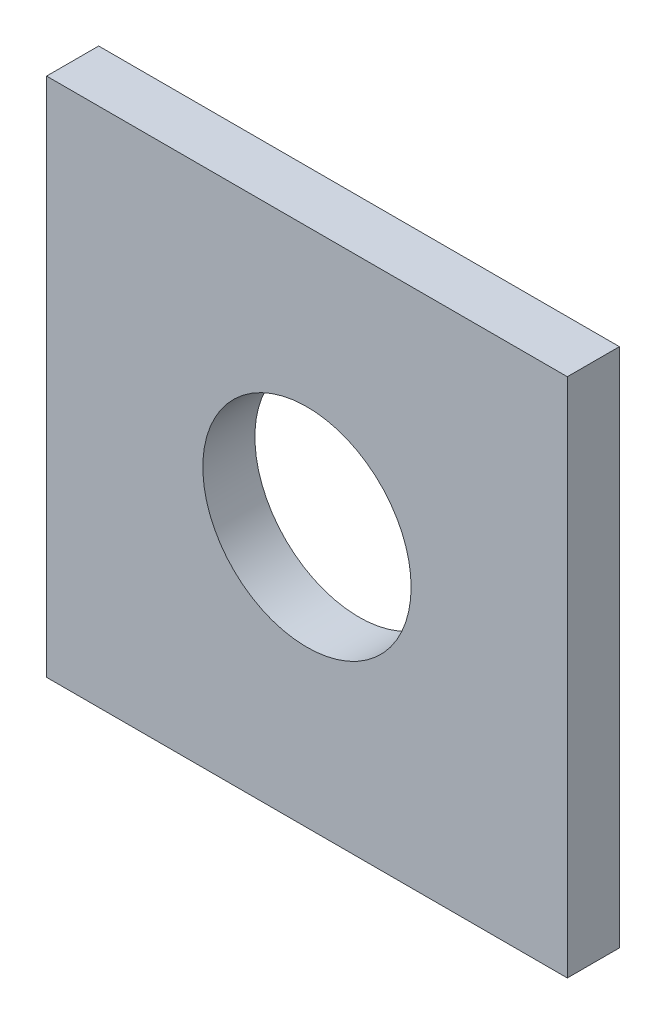
ISO-10303-21;
HEADER;
FILE_DESCRIPTION(('STEP AP214'),'2;1');
FILE_NAME('part.step','',(''),(''),'','','');
FILE_SCHEMA(('AUTOMOTIVE_DESIGN { 1 0 10303 214 1 1 1 1 }'));
ENDSEC;
DATA;
#1=APPLICATION_CONTEXT('core data for automotive mechanical design processes');
#2=APPLICATION_PROTOCOL_DEFINITION('international standard','automotive_design',2000,#1);
#3=PRODUCT_CONTEXT('',#1,'mechanical');
#4=PRODUCT('Part','Part','',(#3));
#5=PRODUCT_RELATED_PRODUCT_CATEGORY('part','',(#4));
#6=PRODUCT_DEFINITION_FORMATION('','',#4);
#7=PRODUCT_DEFINITION_CONTEXT('part definition',#1,'design');
#8=PRODUCT_DEFINITION('design','',#6,#7);
#9=PRODUCT_DEFINITION_SHAPE('','',#8);
#10=(LENGTH_UNIT() NAMED_UNIT(*) SI_UNIT(.MILLI.,.METRE.));
#11=(NAMED_UNIT(*) PLANE_ANGLE_UNIT() SI_UNIT($,.RADIAN.));
#12=(NAMED_UNIT(*) SI_UNIT($,.STERADIAN.) SOLID_ANGLE_UNIT());
#13=UNCERTAINTY_MEASURE_WITH_UNIT(LENGTH_MEASURE(1.E-05),#10,'distance_accuracy_value','');
#14=(GEOMETRIC_REPRESENTATION_CONTEXT(3) GLOBAL_UNCERTAINTY_ASSIGNED_CONTEXT((#13)) GLOBAL_UNIT_ASSIGNED_CONTEXT((#10,
#11,#12)) REPRESENTATION_CONTEXT('',''));
#15=CARTESIAN_POINT('',(0.,0.,0.));
#16=DIRECTION('',(0.,0.,1.));
#17=DIRECTION('',(1.,0.,0.));
#18=AXIS2_PLACEMENT_3D('',#15,#16,#17);
#19=CARTESIAN_POINT('',(0.,0.,1.));
#20=DIRECTION('',(0.,0.,-1.));
#21=DIRECTION('',(-1.,0.,0.));
#22=AXIS2_PLACEMENT_3D('',#19,#20,#21);
#23=PLANE('',#22);
#24=DIRECTION('',(1.,0.,0.));
#25=VECTOR('',#24,1.);
#26=CARTESIAN_POINT('',(10.,0.,1.));
#27=LINE('',#26,#25);
#28=CARTESIAN_POINT('',(0.,0.,1.));
#29=VERTEX_POINT('',#28);
#30=CARTESIAN_POINT('',(10.,0.,1.));
#31=VERTEX_POINT('',#30);
#32=EDGE_CURVE('E89',#29,#31,#27,.T.);
#33=ORIENTED_EDGE('',*,*,#32,.T.);
#34=DIRECTION('',(0.,1.,0.));
#35=VECTOR('',#34,1.);
#36=CARTESIAN_POINT('',(10.,10.,1.));
#37=LINE('',#36,#35);
#38=CARTESIAN_POINT('',(10.,10.,1.));
#39=VERTEX_POINT('',#38);
#40=EDGE_CURVE('E84',#31,#39,#37,.T.);
#41=ORIENTED_EDGE('',*,*,#40,.T.);
#42=DIRECTION('',(-1.,0.,0.));
#43=VECTOR('',#42,1.);
#44=CARTESIAN_POINT('',(0.,10.,1.));
#45=LINE('',#44,#43);
#46=CARTESIAN_POINT('',(0.,10.,1.));
#47=VERTEX_POINT('',#46);
#48=EDGE_CURVE('E87',#39,#47,#45,.T.);
#49=ORIENTED_EDGE('',*,*,#48,.T.);
#50=DIRECTION('',(0.,-1.,0.));
#51=VECTOR('',#50,1.);
#52=CARTESIAN_POINT('',(0.,0.,1.));
#53=LINE('',#52,#51);
#54=EDGE_CURVE('E54',#47,#29,#53,.T.);
#55=ORIENTED_EDGE('',*,*,#54,.T.);
#56=EDGE_LOOP('',(#33,#41,#49,#55));
#57=FACE_BOUND('',#56,.T.);
#58=CARTESIAN_POINT('',(5.,5.,1.));
#59=DIRECTION('',(0.,0.,1.));
#60=DIRECTION('',(1.,0.,0.));
#61=AXIS2_PLACEMENT_3D('',#58,#59,#60);
#62=CIRCLE('',#61,2.);
#63=CARTESIAN_POINT('',(7.,5.,1.));
#64=VERTEX_POINT('',#63);
#65=EDGE_CURVE('E104',#64,#64,#62,.T.);
#66=ORIENTED_EDGE('',*,*,#65,.F.);
#67=EDGE_LOOP('',(#66));
#68=FACE_BOUND('',#67,.T.);
#69=ADVANCED_FACE('F37',(#57,#68),#23,.F.);
#70=CARTESIAN_POINT('',(0.,0.,0.));
#71=DIRECTION('',(0.,0.,-1.));
#72=DIRECTION('',(-1.,0.,0.));
#73=AXIS2_PLACEMENT_3D('',#70,#71,#72);
#74=PLANE('',#73);
#75=DIRECTION('',(1.,0.,0.));
#76=VECTOR('',#75,1.);
#77=CARTESIAN_POINT('',(10.,0.,0.));
#78=LINE('',#77,#76);
#79=CARTESIAN_POINT('',(0.,0.,0.));
#80=VERTEX_POINT('',#79);
#81=CARTESIAN_POINT('',(10.,0.,0.));
#82=VERTEX_POINT('',#81);
#83=EDGE_CURVE('E101',#80,#82,#78,.T.);
#84=ORIENTED_EDGE('',*,*,#83,.F.);
#85=DIRECTION('',(0.,-1.,0.));
#86=VECTOR('',#85,1.);
#87=CARTESIAN_POINT('',(0.,0.,0.));
#88=LINE('',#87,#86);
#89=CARTESIAN_POINT('',(0.,10.,0.));
#90=VERTEX_POINT('',#89);
#91=EDGE_CURVE('E77',#90,#80,#88,.T.);
#92=ORIENTED_EDGE('',*,*,#91,.F.);
#93=DIRECTION('',(-1.,0.,0.));
#94=VECTOR('',#93,1.);
#95=CARTESIAN_POINT('',(0.,10.,0.));
#96=LINE('',#95,#94);
#97=CARTESIAN_POINT('',(10.,10.,0.));
#98=VERTEX_POINT('',#97);
#99=EDGE_CURVE('E71',#98,#90,#96,.T.);
#100=ORIENTED_EDGE('',*,*,#99,.F.);
#101=DIRECTION('',(0.,1.,0.));
#102=VECTOR('',#101,1.);
#103=CARTESIAN_POINT('',(10.,10.,0.));
#104=LINE('',#103,#102);
#105=EDGE_CURVE('E93',#82,#98,#104,.T.);
#106=ORIENTED_EDGE('',*,*,#105,.F.);
#107=EDGE_LOOP('',(#84,#92,#100,#106));
#108=FACE_BOUND('',#107,.T.);
#109=CARTESIAN_POINT('',(5.,5.,0.));
#110=DIRECTION('',(0.,0.,1.));
#111=DIRECTION('',(1.,0.,0.));
#112=AXIS2_PLACEMENT_3D('',#109,#110,#111);
#113=CIRCLE('',#112,2.);
#114=CARTESIAN_POINT('',(7.,5.,0.));
#115=VERTEX_POINT('',#114);
#116=EDGE_CURVE('E116',#115,#115,#113,.T.);
#117=ORIENTED_EDGE('',*,*,#116,.T.);
#118=EDGE_LOOP('',(#117));
#119=FACE_BOUND('',#118,.T.);
#120=ADVANCED_FACE('F112',(#108,#119),#74,.T.);
#121=CARTESIAN_POINT('',(10.,0.,1.));
#122=DIRECTION('',(0.,1.,0.));
#123=DIRECTION('',(0.,0.,1.));
#124=AXIS2_PLACEMENT_3D('',#121,#122,#123);
#125=PLANE('',#124);
#126=ORIENTED_EDGE('',*,*,#83,.T.);
#127=DIRECTION('',(0.,0.,-1.));
#128=VECTOR('',#127,1.);
#129=CARTESIAN_POINT('',(10.,0.,1.));
#130=LINE('',#129,#128);
#131=EDGE_CURVE('E11',#31,#82,#130,.T.);
#132=ORIENTED_EDGE('',*,*,#131,.F.);
#133=ORIENTED_EDGE('',*,*,#32,.F.);
#134=DIRECTION('',(0.,0.,-1.));
#135=VECTOR('',#134,1.);
#136=CARTESIAN_POINT('',(0.,0.,1.));
#137=LINE('',#136,#135);
#138=EDGE_CURVE('E97',#29,#80,#137,.T.);
#139=ORIENTED_EDGE('',*,*,#138,.T.);
#140=EDGE_LOOP('',(#126,#132,#133,#139));
#141=FACE_BOUND('',#140,.T.);
#142=ADVANCED_FACE('F39',(#141),#125,.F.);
#143=CARTESIAN_POINT('',(10.,10.,1.));
#144=DIRECTION('',(-1.,0.,0.));
#145=DIRECTION('',(0.,0.,1.));
#146=AXIS2_PLACEMENT_3D('',#143,#144,#145);
#147=PLANE('',#146);
#148=ORIENTED_EDGE('',*,*,#105,.T.);
#149=DIRECTION('',(0.,0.,-1.));
#150=VECTOR('',#149,1.);
#151=CARTESIAN_POINT('',(10.,10.,1.));
#152=LINE('',#151,#150);
#153=EDGE_CURVE('E46',#39,#98,#152,.T.);
#154=ORIENTED_EDGE('',*,*,#153,.F.);
#155=ORIENTED_EDGE('',*,*,#40,.F.);
#156=ORIENTED_EDGE('',*,*,#131,.T.);
#157=EDGE_LOOP('',(#148,#154,#155,#156));
#158=FACE_BOUND('',#157,.T.);
#159=ADVANCED_FACE('F92',(#158),#147,.F.);
#160=CARTESIAN_POINT('',(0.,10.,1.));
#161=DIRECTION('',(0.,-1.,0.));
#162=DIRECTION('',(0.,0.,-1.));
#163=AXIS2_PLACEMENT_3D('',#160,#161,#162);
#164=PLANE('',#163);
#165=ORIENTED_EDGE('',*,*,#99,.T.);
#166=DIRECTION('',(0.,0.,-1.));
#167=VECTOR('',#166,1.);
#168=CARTESIAN_POINT('',(0.,10.,1.));
#169=LINE('',#168,#167);
#170=EDGE_CURVE('E94',#47,#90,#169,.T.);
#171=ORIENTED_EDGE('',*,*,#170,.F.);
#172=ORIENTED_EDGE('',*,*,#48,.F.);
#173=ORIENTED_EDGE('',*,*,#153,.T.);
#174=EDGE_LOOP('',(#165,#171,#172,#173));
#175=FACE_BOUND('',#174,.T.);
#176=ADVANCED_FACE('F95',(#175),#164,.F.);
#177=CARTESIAN_POINT('',(0.,0.,1.));
#178=DIRECTION('',(1.,0.,0.));
#179=DIRECTION('',(0.,0.,-1.));
#180=AXIS2_PLACEMENT_3D('',#177,#178,#179);
#181=PLANE('',#180);
#182=ORIENTED_EDGE('',*,*,#91,.T.);
#183=ORIENTED_EDGE('',*,*,#138,.F.);
#184=ORIENTED_EDGE('',*,*,#54,.F.);
#185=ORIENTED_EDGE('',*,*,#170,.T.);
#186=EDGE_LOOP('',(#182,#183,#184,#185));
#187=FACE_BOUND('',#186,.T.);
#188=ADVANCED_FACE('F109',(#187),#181,.F.);
#189=CARTESIAN_POINT('',(5.,5.,1.));
#190=DIRECTION('',(0.,0.,-1.));
#191=DIRECTION('',(-1.,0.,0.));
#192=AXIS2_PLACEMENT_3D('',#189,#190,#191);
#193=CYLINDRICAL_SURFACE('',#192,2.);
#194=ORIENTED_EDGE('',*,*,#65,.T.);
#195=EDGE_LOOP('',(#194));
#196=FACE_BOUND('',#195,.T.);
#197=ORIENTED_EDGE('',*,*,#116,.F.);
#198=EDGE_LOOP('',(#197));
#199=FACE_BOUND('',#198,.T.);
#200=ADVANCED_FACE('F122',(#196,#199),#193,.F.);
#201=CLOSED_SHELL('',(#69,#120,#142,#159,#176,#188,#200));
#202=MANIFOLD_SOLID_BREP('B2',#201);
#203=ADVANCED_BREP_SHAPE_REPRESENTATION('',(#18,#202),#14);
#204=SHAPE_DEFINITION_REPRESENTATION(#9,#203);
ENDSEC;
END-ISO-10303-21;
